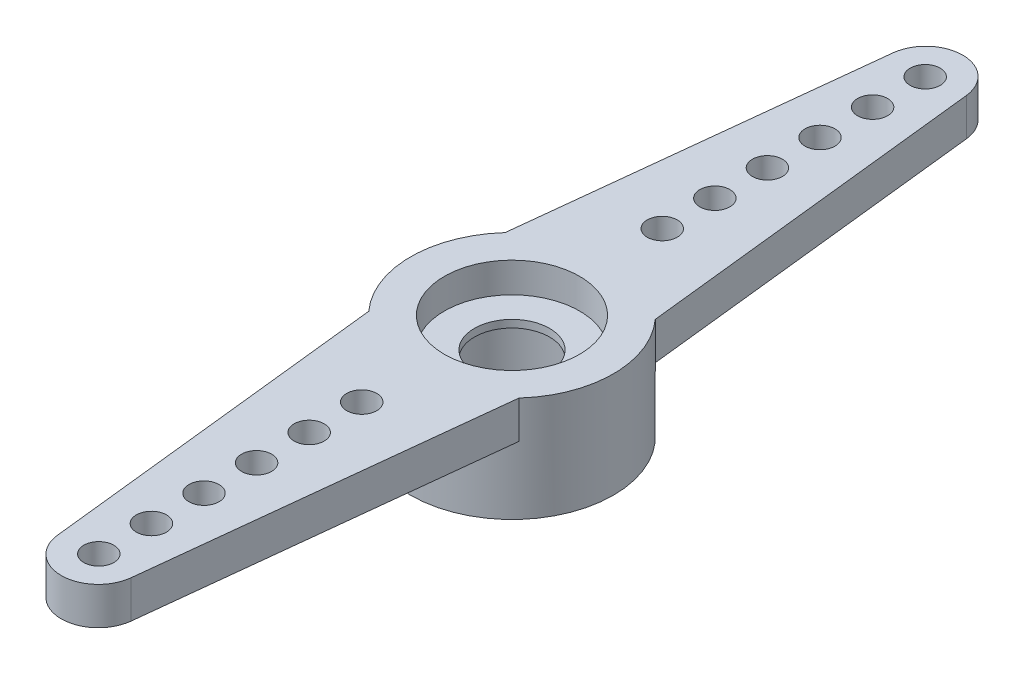
ISO-10303-21;
HEADER;
FILE_DESCRIPTION(('STEP AP214'),'2;1');
FILE_NAME('part.step','',(''),(''),'','','');
FILE_SCHEMA(('AUTOMOTIVE_DESIGN { 1 0 10303 214 1 1 1 1 }'));
ENDSEC;
DATA;
#1=APPLICATION_CONTEXT('core data for automotive mechanical design processes');
#2=APPLICATION_PROTOCOL_DEFINITION('international standard','automotive_design',2000,#1);
#3=PRODUCT_CONTEXT('',#1,'mechanical');
#4=PRODUCT('Part','Part','',(#3));
#5=PRODUCT_RELATED_PRODUCT_CATEGORY('part','',(#4));
#6=PRODUCT_DEFINITION_FORMATION('','',#4);
#7=PRODUCT_DEFINITION_CONTEXT('part definition',#1,'design');
#8=PRODUCT_DEFINITION('design','',#6,#7);
#9=PRODUCT_DEFINITION_SHAPE('','',#8);
#10=(LENGTH_UNIT() NAMED_UNIT(*) SI_UNIT(.MILLI.,.METRE.));
#11=(NAMED_UNIT(*) PLANE_ANGLE_UNIT() SI_UNIT($,.RADIAN.));
#12=(NAMED_UNIT(*) SI_UNIT($,.STERADIAN.) SOLID_ANGLE_UNIT());
#13=UNCERTAINTY_MEASURE_WITH_UNIT(LENGTH_MEASURE(1.E-05),#10,'distance_accuracy_value','');
#14=(GEOMETRIC_REPRESENTATION_CONTEXT(3) GLOBAL_UNCERTAINTY_ASSIGNED_CONTEXT((#13)) GLOBAL_UNIT_ASSIGNED_CONTEXT((#10,
#11,#12)) REPRESENTATION_CONTEXT('',''));
#15=CARTESIAN_POINT('',(0.,0.,0.));
#16=DIRECTION('',(0.,0.,1.));
#17=DIRECTION('',(1.,0.,0.));
#18=AXIS2_PLACEMENT_3D('',#15,#16,#17);
#19=CARTESIAN_POINT('',(0.,3.556,0.));
#20=DIRECTION('',(0.,-1.,0.));
#21=DIRECTION('',(0.,0.,-1.));
#22=AXIS2_PLACEMENT_3D('',#19,#20,#21);
#23=CYLINDRICAL_SURFACE('',#22,3.429);
#24=DIRECTION('',(0.,1.,0.));
#25=VECTOR('',#24,1.);
#26=CARTESIAN_POINT('',(-2.54,2.286,2.30357135769657));
#27=LINE('',#26,#25);
#28=CARTESIAN_POINT('',(-2.54,2.286,2.30357135769657));
#29=VERTEX_POINT('',#28);
#30=CARTESIAN_POINT('',(-2.54,3.556,2.30357135769657));
#31=VERTEX_POINT('',#30);
#32=EDGE_CURVE('E159',#29,#31,#27,.T.);
#33=ORIENTED_EDGE('',*,*,#32,.T.);
#34=CARTESIAN_POINT('',(0.,3.556,0.));
#35=DIRECTION('',(0.,1.,0.));
#36=DIRECTION('',(0.,0.,1.));
#37=AXIS2_PLACEMENT_3D('',#34,#35,#36);
#38=CIRCLE('',#37,3.429);
#39=CARTESIAN_POINT('',(-2.54,3.556,-2.30357135769657));
#40=VERTEX_POINT('',#39);
#41=EDGE_CURVE('E254',#40,#31,#38,.T.);
#42=ORIENTED_EDGE('',*,*,#41,.F.);
#43=DIRECTION('',(0.,1.,0.));
#44=VECTOR('',#43,1.);
#45=CARTESIAN_POINT('',(-2.54,2.286,-2.30357135769657));
#46=LINE('',#45,#44);
#47=CARTESIAN_POINT('',(-2.54,2.286,-2.30357135769657));
#48=VERTEX_POINT('',#47);
#49=EDGE_CURVE('E55',#48,#40,#46,.T.);
#50=ORIENTED_EDGE('',*,*,#49,.F.);
#51=CARTESIAN_POINT('',(0.,2.286,0.));
#52=DIRECTION('',(0.,1.,0.));
#53=DIRECTION('',(0.,0.,1.));
#54=AXIS2_PLACEMENT_3D('',#51,#52,#53);
#55=CIRCLE('',#54,3.429);
#56=CARTESIAN_POINT('',(2.54,2.286,-2.30357135769657));
#57=VERTEX_POINT('',#56);
#58=EDGE_CURVE('E215',#57,#48,#55,.T.);
#59=ORIENTED_EDGE('',*,*,#58,.F.);
#60=DIRECTION('',(0.,1.,0.));
#61=VECTOR('',#60,1.);
#62=CARTESIAN_POINT('',(2.54,2.286,-2.30357135769657));
#63=LINE('',#62,#61);
#64=CARTESIAN_POINT('',(2.54,3.556,-2.30357135769657));
#65=VERTEX_POINT('',#64);
#66=EDGE_CURVE('E83',#57,#65,#63,.T.);
#67=ORIENTED_EDGE('',*,*,#66,.T.);
#68=CARTESIAN_POINT('',(2.54,3.556,2.30357135769657));
#69=VERTEX_POINT('',#68);
#70=EDGE_CURVE('E137',#69,#65,#38,.T.);
#71=ORIENTED_EDGE('',*,*,#70,.F.);
#72=DIRECTION('',(0.,1.,0.));
#73=VECTOR('',#72,1.);
#74=CARTESIAN_POINT('',(2.54,2.286,2.30357135769657));
#75=LINE('',#74,#73);
#76=CARTESIAN_POINT('',(2.54,2.286,2.30357135769657));
#77=VERTEX_POINT('',#76);
#78=EDGE_CURVE('E117',#77,#69,#75,.T.);
#79=ORIENTED_EDGE('',*,*,#78,.F.);
#80=CARTESIAN_POINT('',(0.,2.286,0.));
#81=DIRECTION('',(0.,-1.,0.));
#82=DIRECTION('',(0.,0.,-1.));
#83=AXIS2_PLACEMENT_3D('',#80,#81,#82);
#84=CIRCLE('',#83,3.429);
#85=EDGE_CURVE('E123',#77,#29,#84,.T.);
#86=ORIENTED_EDGE('',*,*,#85,.T.);
#87=EDGE_LOOP('',(#33,#42,#50,#59,#67,#71,#79,#86));
#88=FACE_BOUND('',#87,.T.);
#89=CARTESIAN_POINT('',(0.,0.,0.));
#90=DIRECTION('',(0.,1.,0.));
#91=DIRECTION('',(0.,0.,1.));
#92=AXIS2_PLACEMENT_3D('',#89,#90,#91);
#93=CIRCLE('',#92,3.429);
#94=CARTESIAN_POINT('',(0.,0.,3.429));
#95=VERTEX_POINT('',#94);
#96=EDGE_CURVE('E250',#95,#95,#93,.T.);
#97=ORIENTED_EDGE('',*,*,#96,.T.);
#98=EDGE_LOOP('',(#97));
#99=FACE_BOUND('',#98,.T.);
#100=ADVANCED_FACE('F38',(#88,#99),#23,.T.);
#101=CARTESIAN_POINT('',(0.,0.,-12.192));
#102=DIRECTION('',(0.,1.,0.));
#103=DIRECTION('',(0.,0.,1.));
#104=AXIS2_PLACEMENT_3D('',#101,#102,#103);
#105=CYLINDRICAL_SURFACE('',#104,0.508);
#106=CARTESIAN_POINT('',(0.,3.556,-12.192));
#107=DIRECTION('',(0.,1.,0.));
#108=DIRECTION('',(0.,0.,1.));
#109=AXIS2_PLACEMENT_3D('',#106,#107,#108);
#110=CIRCLE('',#109,0.508);
#111=CARTESIAN_POINT('',(0.,3.556,-11.684));
#112=VERTEX_POINT('',#111);
#113=EDGE_CURVE('E48',#112,#112,#110,.T.);
#114=ORIENTED_EDGE('',*,*,#113,.T.);
#115=EDGE_LOOP('',(#114));
#116=FACE_BOUND('',#115,.T.);
#117=CARTESIAN_POINT('',(0.,2.286,-12.192));
#118=DIRECTION('',(0.,1.,0.));
#119=DIRECTION('',(0.,0.,1.));
#120=AXIS2_PLACEMENT_3D('',#117,#118,#119);
#121=CIRCLE('',#120,0.508);
#122=CARTESIAN_POINT('',(0.,2.286,-11.684));
#123=VERTEX_POINT('',#122);
#124=EDGE_CURVE('E11',#123,#123,#121,.T.);
#125=ORIENTED_EDGE('',*,*,#124,.F.);
#126=EDGE_LOOP('',(#125));
#127=FACE_BOUND('',#126,.T.);
#128=ADVANCED_FACE('F40',(#116,#127),#105,.F.);
#129=CARTESIAN_POINT('',(0.,0.,-10.414));
#130=DIRECTION('',(0.,1.,0.));
#131=DIRECTION('',(0.,0.,1.));
#132=AXIS2_PLACEMENT_3D('',#129,#130,#131);
#133=CYLINDRICAL_SURFACE('',#132,0.508);
#134=CARTESIAN_POINT('',(0.,3.556,-10.414));
#135=DIRECTION('',(0.,1.,0.));
#136=DIRECTION('',(0.,0.,1.));
#137=AXIS2_PLACEMENT_3D('',#134,#135,#136);
#138=CIRCLE('',#137,0.508);
#139=CARTESIAN_POINT('',(0.,3.556,-9.906));
#140=VERTEX_POINT('',#139);
#141=EDGE_CURVE('E275',#140,#140,#138,.T.);
#142=ORIENTED_EDGE('',*,*,#141,.T.);
#143=EDGE_LOOP('',(#142));
#144=FACE_BOUND('',#143,.T.);
#145=CARTESIAN_POINT('',(0.,2.286,-10.414));
#146=DIRECTION('',(0.,1.,0.));
#147=DIRECTION('',(0.,0.,1.));
#148=AXIS2_PLACEMENT_3D('',#145,#146,#147);
#149=CIRCLE('',#148,0.508);
#150=CARTESIAN_POINT('',(0.,2.286,-9.906));
#151=VERTEX_POINT('',#150);
#152=EDGE_CURVE('E279',#151,#151,#149,.T.);
#153=ORIENTED_EDGE('',*,*,#152,.F.);
#154=EDGE_LOOP('',(#153));
#155=FACE_BOUND('',#154,.T.);
#156=ADVANCED_FACE('F342',(#144,#155),#133,.F.);
#157=CARTESIAN_POINT('',(0.,0.,-8.636));
#158=DIRECTION('',(0.,1.,0.));
#159=DIRECTION('',(0.,0.,1.));
#160=AXIS2_PLACEMENT_3D('',#157,#158,#159);
#161=CYLINDRICAL_SURFACE('',#160,0.508);
#162=CARTESIAN_POINT('',(0.,3.556,-8.636));
#163=DIRECTION('',(0.,1.,0.));
#164=DIRECTION('',(0.,0.,1.));
#165=AXIS2_PLACEMENT_3D('',#162,#163,#164);
#166=CIRCLE('',#165,0.508);
#167=CARTESIAN_POINT('',(0.,3.556,-8.128));
#168=VERTEX_POINT('',#167);
#169=EDGE_CURVE('E264',#168,#168,#166,.T.);
#170=ORIENTED_EDGE('',*,*,#169,.T.);
#171=EDGE_LOOP('',(#170));
#172=FACE_BOUND('',#171,.T.);
#173=CARTESIAN_POINT('',(0.,2.286,-8.636));
#174=DIRECTION('',(0.,1.,0.));
#175=DIRECTION('',(0.,0.,1.));
#176=AXIS2_PLACEMENT_3D('',#173,#174,#175);
#177=CIRCLE('',#176,0.508);
#178=CARTESIAN_POINT('',(0.,2.286,-8.128));
#179=VERTEX_POINT('',#178);
#180=EDGE_CURVE('E271',#179,#179,#177,.T.);
#181=ORIENTED_EDGE('',*,*,#180,.F.);
#182=EDGE_LOOP('',(#181));
#183=FACE_BOUND('',#182,.T.);
#184=ADVANCED_FACE('F345',(#172,#183),#161,.F.);
#185=CARTESIAN_POINT('',(0.,3.556,0.));
#186=DIRECTION('',(0.,-1.,0.));
#187=DIRECTION('',(0.,0.,-1.));
#188=AXIS2_PLACEMENT_3D('',#185,#186,#187);
#189=CYLINDRICAL_SURFACE('',#188,2.286);
#190=CARTESIAN_POINT('',(0.,2.286,0.));
#191=DIRECTION('',(0.,1.,0.));
#192=DIRECTION('',(0.,0.,1.));
#193=AXIS2_PLACEMENT_3D('',#190,#191,#192);
#194=CIRCLE('',#193,2.286);
#195=CARTESIAN_POINT('',(0.,2.286,2.286));
#196=VERTEX_POINT('',#195);
#197=EDGE_CURVE('E202',#196,#196,#194,.F.);
#198=ORIENTED_EDGE('',*,*,#197,.F.);
#199=EDGE_LOOP('',(#198));
#200=FACE_BOUND('',#199,.T.);
#201=CARTESIAN_POINT('',(0.,0.,0.));
#202=DIRECTION('',(0.,1.,0.));
#203=DIRECTION('',(0.,0.,1.));
#204=AXIS2_PLACEMENT_3D('',#201,#202,#203);
#205=CIRCLE('',#204,2.286);
#206=CARTESIAN_POINT('',(0.,0.,2.286));
#207=VERTEX_POINT('',#206);
#208=EDGE_CURVE('E237',#207,#207,#205,.T.);
#209=ORIENTED_EDGE('',*,*,#208,.F.);
#210=EDGE_LOOP('',(#209));
#211=FACE_BOUND('',#210,.T.);
#212=ADVANCED_FACE('F293',(#200,#211),#189,.F.);
#213=CARTESIAN_POINT('',(0.,3.556,0.));
#214=DIRECTION('',(0.,1.,0.));
#215=DIRECTION('',(0.,0.,1.));
#216=AXIS2_PLACEMENT_3D('',#213,#214,#215);
#217=PLANE('',#216);
#218=ORIENTED_EDGE('',*,*,#41,.T.);
#219=DIRECTION('',(0.108941168435119,0.,0.994048198942079));
#220=VECTOR('',#219,1.);
#221=CARTESIAN_POINT('',(-2.75931495587774,3.556,0.302402836898391));
#222=LINE('',#221,#220);
#223=CARTESIAN_POINT('',(-1.24451166089778,3.556,14.1244272263572));
#224=VERTEX_POINT('',#223);
#225=EDGE_CURVE('E134',#31,#224,#222,.T.);
#226=ORIENTED_EDGE('',*,*,#225,.T.);
#227=CARTESIAN_POINT('',(0.,3.556,13.9880369038219));
#228=DIRECTION('',(0.,-1.,0.));
#229=DIRECTION('',(0.,0.,-1.));
#230=AXIS2_PLACEMENT_3D('',#227,#228,#229);
#231=CIRCLE('',#230,1.25196309617809);
#232=CARTESIAN_POINT('',(1.24451166089778,3.556,14.1244272263572));
#233=VERTEX_POINT('',#232);
#234=EDGE_CURVE('E447',#224,#233,#231,.F.);
#235=ORIENTED_EDGE('',*,*,#234,.T.);
#236=DIRECTION('',(-0.108941168435119,0.,0.994048198942079));
#237=VECTOR('',#236,1.);
#238=CARTESIAN_POINT('',(2.75931495587774,3.556,0.302402836898391));
#239=LINE('',#238,#237);
#240=EDGE_CURVE('E152',#69,#233,#239,.T.);
#241=ORIENTED_EDGE('',*,*,#240,.F.);
#242=ORIENTED_EDGE('',*,*,#70,.T.);
#243=DIRECTION('',(-0.108941168435119,0.,-0.994048198942079));
#244=VECTOR('',#243,1.);
#245=CARTESIAN_POINT('',(2.75931495587774,3.556,-0.302402836898391));
#246=LINE('',#245,#244);
#247=CARTESIAN_POINT('',(1.24451166089778,3.556,-14.1244272263572));
#248=VERTEX_POINT('',#247);
#249=EDGE_CURVE('E211',#65,#248,#246,.T.);
#250=ORIENTED_EDGE('',*,*,#249,.T.);
#251=CARTESIAN_POINT('',(0.,3.556,-13.9880369038219));
#252=DIRECTION('',(0.,1.,0.));
#253=DIRECTION('',(0.,0.,1.));
#254=AXIS2_PLACEMENT_3D('',#251,#252,#253);
#255=CIRCLE('',#254,1.25196309617809);
#256=CARTESIAN_POINT('',(-1.24451166089778,3.556,-14.1244272263572));
#257=VERTEX_POINT('',#256);
#258=EDGE_CURVE('E229',#257,#248,#255,.F.);
#259=ORIENTED_EDGE('',*,*,#258,.F.);
#260=DIRECTION('',(0.108941168435119,0.,-0.994048198942079));
#261=VECTOR('',#260,1.);
#262=CARTESIAN_POINT('',(-2.75931495587774,3.556,-0.302402836898391));
#263=LINE('',#262,#261);
#264=EDGE_CURVE('E75',#40,#257,#263,.T.);
#265=ORIENTED_EDGE('',*,*,#264,.F.);
#266=EDGE_LOOP('',(#218,#226,#235,#241,#242,#250,#259,#265));
#267=FACE_BOUND('',#266,.T.);
#268=CARTESIAN_POINT('',(0.,3.556,0.));
#269=DIRECTION('',(0.,1.,0.));
#270=DIRECTION('',(0.,0.,1.));
#271=AXIS2_PLACEMENT_3D('',#268,#269,#270);
#272=CIRCLE('',#271,2.286);
#273=CARTESIAN_POINT('',(0.,3.556,2.286));
#274=VERTEX_POINT('',#273);
#275=EDGE_CURVE('E246',#274,#274,#272,.T.);
#276=ORIENTED_EDGE('',*,*,#275,.F.);
#277=EDGE_LOOP('',(#276));
#278=FACE_BOUND('',#277,.T.);
#279=CARTESIAN_POINT('',(0.,3.556,-13.97));
#280=DIRECTION('',(0.,1.,0.));
#281=DIRECTION('',(0.,0.,1.));
#282=AXIS2_PLACEMENT_3D('',#279,#280,#281);
#283=CIRCLE('',#282,0.508);
#284=CARTESIAN_POINT('',(0.,3.556,-13.462));
#285=VERTEX_POINT('',#284);
#286=EDGE_CURVE('E179',#285,#285,#283,.T.);
#287=ORIENTED_EDGE('',*,*,#286,.F.);
#288=EDGE_LOOP('',(#287));
#289=FACE_BOUND('',#288,.T.);
#290=CARTESIAN_POINT('',(0.,3.556,-6.858));
#291=DIRECTION('',(0.,1.,0.));
#292=DIRECTION('',(0.,0.,1.));
#293=AXIS2_PLACEMENT_3D('',#290,#291,#292);
#294=CIRCLE('',#293,0.508);
#295=CARTESIAN_POINT('',(0.,3.556,-6.35));
#296=VERTEX_POINT('',#295);
#297=EDGE_CURVE('E189',#296,#296,#294,.T.);
#298=ORIENTED_EDGE('',*,*,#297,.F.);
#299=EDGE_LOOP('',(#298));
#300=FACE_BOUND('',#299,.T.);
#301=CARTESIAN_POINT('',(0.,3.556,-5.08));
#302=DIRECTION('',(0.,1.,0.));
#303=DIRECTION('',(0.,0.,1.));
#304=AXIS2_PLACEMENT_3D('',#301,#302,#303);
#305=CIRCLE('',#304,0.508);
#306=CARTESIAN_POINT('',(0.,3.556,-4.572));
#307=VERTEX_POINT('',#306);
#308=EDGE_CURVE('E197',#307,#307,#305,.T.);
#309=ORIENTED_EDGE('',*,*,#308,.F.);
#310=EDGE_LOOP('',(#309));
#311=FACE_BOUND('',#310,.T.);
#312=ORIENTED_EDGE('',*,*,#169,.F.);
#313=EDGE_LOOP('',(#312));
#314=FACE_BOUND('',#313,.T.);
#315=ORIENTED_EDGE('',*,*,#141,.F.);
#316=EDGE_LOOP('',(#315));
#317=FACE_BOUND('',#316,.T.);
#318=ORIENTED_EDGE('',*,*,#113,.F.);
#319=EDGE_LOOP('',(#318));
#320=FACE_BOUND('',#319,.T.);
#321=CARTESIAN_POINT('',(0.,3.556,13.97));
#322=DIRECTION('',(0.,-1.,0.));
#323=DIRECTION('',(0.,0.,-1.));
#324=AXIS2_PLACEMENT_3D('',#321,#322,#323);
#325=CIRCLE('',#324,0.508);
#326=CARTESIAN_POINT('',(0.,3.556,13.462));
#327=VERTEX_POINT('',#326);
#328=EDGE_CURVE('E185',#327,#327,#325,.T.);
#329=ORIENTED_EDGE('',*,*,#328,.T.);
#330=EDGE_LOOP('',(#329));
#331=FACE_BOUND('',#330,.T.);
#332=CARTESIAN_POINT('',(0.,3.556,6.858));
#333=DIRECTION('',(0.,-1.,0.));
#334=DIRECTION('',(0.,0.,-1.));
#335=AXIS2_PLACEMENT_3D('',#332,#333,#334);
#336=CIRCLE('',#335,0.508);
#337=CARTESIAN_POINT('',(0.,3.556,6.35));
#338=VERTEX_POINT('',#337);
#339=EDGE_CURVE('E184',#338,#338,#336,.T.);
#340=ORIENTED_EDGE('',*,*,#339,.T.);
#341=EDGE_LOOP('',(#340));
#342=FACE_BOUND('',#341,.T.);
#343=CARTESIAN_POINT('',(0.,3.556,5.08));
#344=DIRECTION('',(0.,-1.,0.));
#345=DIRECTION('',(0.,0.,-1.));
#346=AXIS2_PLACEMENT_3D('',#343,#344,#345);
#347=CIRCLE('',#346,0.508);
#348=CARTESIAN_POINT('',(0.,3.556,4.572));
#349=VERTEX_POINT('',#348);
#350=EDGE_CURVE('E153',#349,#349,#347,.T.);
#351=ORIENTED_EDGE('',*,*,#350,.T.);
#352=EDGE_LOOP('',(#351));
#353=FACE_BOUND('',#352,.T.);
#354=CARTESIAN_POINT('',(0.,3.556,8.636));
#355=DIRECTION('',(0.,-1.,0.));
#356=DIRECTION('',(0.,0.,-1.));
#357=AXIS2_PLACEMENT_3D('',#354,#355,#356);
#358=CIRCLE('',#357,0.508);
#359=CARTESIAN_POINT('',(0.,3.556,8.128));
#360=VERTEX_POINT('',#359);
#361=EDGE_CURVE('E154',#360,#360,#358,.T.);
#362=ORIENTED_EDGE('',*,*,#361,.T.);
#363=EDGE_LOOP('',(#362));
#364=FACE_BOUND('',#363,.T.);
#365=CARTESIAN_POINT('',(0.,3.556,10.414));
#366=DIRECTION('',(0.,-1.,0.));
#367=DIRECTION('',(0.,0.,-1.));
#368=AXIS2_PLACEMENT_3D('',#365,#366,#367);
#369=CIRCLE('',#368,0.508);
#370=CARTESIAN_POINT('',(0.,3.556,9.906));
#371=VERTEX_POINT('',#370);
#372=EDGE_CURVE('E163',#371,#371,#369,.T.);
#373=ORIENTED_EDGE('',*,*,#372,.T.);
#374=EDGE_LOOP('',(#373));
#375=FACE_BOUND('',#374,.T.);
#376=CARTESIAN_POINT('',(0.,3.556,12.192));
#377=DIRECTION('',(0.,-1.,0.));
#378=DIRECTION('',(0.,0.,-1.));
#379=AXIS2_PLACEMENT_3D('',#376,#377,#378);
#380=CIRCLE('',#379,0.508);
#381=CARTESIAN_POINT('',(0.,3.556,11.684));
#382=VERTEX_POINT('',#381);
#383=EDGE_CURVE('E171',#382,#382,#380,.T.);
#384=ORIENTED_EDGE('',*,*,#383,.T.);
#385=EDGE_LOOP('',(#384));
#386=FACE_BOUND('',#385,.T.);
#387=ADVANCED_FACE('F289',(#267,#278,#289,#300,#311,#314,#317,#320,#331,#342,#353,#364,#375,
#386),#217,.T.);
#388=CARTESIAN_POINT('',(0.,0.,0.));
#389=DIRECTION('',(0.,1.,0.));
#390=DIRECTION('',(0.,0.,1.));
#391=AXIS2_PLACEMENT_3D('',#388,#389,#390);
#392=PLANE('',#391);
#393=ORIENTED_EDGE('',*,*,#208,.T.);
#394=EDGE_LOOP('',(#393));
#395=FACE_BOUND('',#394,.T.);
#396=ORIENTED_EDGE('',*,*,#96,.F.);
#397=EDGE_LOOP('',(#396));
#398=FACE_BOUND('',#397,.T.);
#399=ADVANCED_FACE('F292',(#395,#398),#392,.F.);
#400=ORIENTED_EDGE('',*,*,#275,.T.);
#401=EDGE_LOOP('',(#400));
#402=FACE_BOUND('',#401,.T.);
#403=CARTESIAN_POINT('',(0.,2.54,0.));
#404=DIRECTION('',(0.,1.,0.));
#405=DIRECTION('',(0.,0.,1.));
#406=AXIS2_PLACEMENT_3D('',#403,#404,#405);
#407=CIRCLE('',#406,2.286);
#408=CARTESIAN_POINT('',(0.,2.54,2.286));
#409=VERTEX_POINT('',#408);
#410=EDGE_CURVE('E257',#409,#409,#407,.T.);
#411=ORIENTED_EDGE('',*,*,#410,.F.);
#412=EDGE_LOOP('',(#411));
#413=FACE_BOUND('',#412,.T.);
#414=ADVANCED_FACE('F383',(#402,#413),#189,.F.);
#415=CARTESIAN_POINT('',(-2.75931495587774,2.286,-0.302402836898391));
#416=DIRECTION('',(0.994048198942079,0.,0.108941168435119));
#417=DIRECTION('',(0.108941168435119,0.,-0.994048198942079));
#418=AXIS2_PLACEMENT_3D('',#415,#416,#417);
#419=PLANE('',#418);
#420=ORIENTED_EDGE('',*,*,#264,.T.);
#421=DIRECTION('',(0.,1.,0.));
#422=VECTOR('',#421,1.);
#423=CARTESIAN_POINT('',(-1.24451166089778,2.286,-14.1244272263572));
#424=LINE('',#423,#422);
#425=CARTESIAN_POINT('',(-1.24451166089778,2.286,-14.1244272263572));
#426=VERTEX_POINT('',#425);
#427=EDGE_CURVE('E238',#426,#257,#424,.T.);
#428=ORIENTED_EDGE('',*,*,#427,.F.);
#429=DIRECTION('',(0.108941168435119,0.,-0.994048198942079));
#430=VECTOR('',#429,1.);
#431=CARTESIAN_POINT('',(-2.75931495587774,2.286,-0.302402836898391));
#432=LINE('',#431,#430);
#433=EDGE_CURVE('E61',#48,#426,#432,.T.);
#434=ORIENTED_EDGE('',*,*,#433,.F.);
#435=ORIENTED_EDGE('',*,*,#49,.T.);
#436=EDGE_LOOP('',(#420,#428,#434,#435));
#437=FACE_BOUND('',#436,.T.);
#438=ADVANCED_FACE('F380',(#437),#419,.F.);
#439=CARTESIAN_POINT('',(0.,2.286,-13.9880369038219));
#440=DIRECTION('',(0.,1.,0.));
#441=DIRECTION('',(0.,0.,1.));
#442=AXIS2_PLACEMENT_3D('',#439,#440,#441);
#443=CYLINDRICAL_SURFACE('',#442,1.25196309617809);
#444=ORIENTED_EDGE('',*,*,#258,.T.);
#445=DIRECTION('',(0.,1.,0.));
#446=VECTOR('',#445,1.);
#447=CARTESIAN_POINT('',(1.24451166089778,2.286,-14.1244272263572));
#448=LINE('',#447,#446);
#449=CARTESIAN_POINT('',(1.24451166089778,2.286,-14.1244272263572));
#450=VERTEX_POINT('',#449);
#451=EDGE_CURVE('E241',#450,#248,#448,.T.);
#452=ORIENTED_EDGE('',*,*,#451,.F.);
#453=CARTESIAN_POINT('',(0.,2.286,-13.9880369038219));
#454=DIRECTION('',(0.,1.,0.));
#455=DIRECTION('',(0.,0.,1.));
#456=AXIS2_PLACEMENT_3D('',#453,#454,#455);
#457=CIRCLE('',#456,1.25196309617809);
#458=EDGE_CURVE('E221',#426,#450,#457,.F.);
#459=ORIENTED_EDGE('',*,*,#458,.F.);
#460=ORIENTED_EDGE('',*,*,#427,.T.);
#461=EDGE_LOOP('',(#444,#452,#459,#460));
#462=FACE_BOUND('',#461,.T.);
#463=ADVANCED_FACE('F374',(#462),#443,.T.);
#464=CARTESIAN_POINT('',(2.75931495587774,2.286,-0.302402836898391));
#465=DIRECTION('',(0.994048198942079,0.,-0.108941168435119));
#466=DIRECTION('',(-0.108941168435119,0.,-0.994048198942079));
#467=AXIS2_PLACEMENT_3D('',#464,#465,#466);
#468=PLANE('',#467);
#469=ORIENTED_EDGE('',*,*,#249,.F.);
#470=ORIENTED_EDGE('',*,*,#66,.F.);
#471=DIRECTION('',(-0.108941168435119,0.,-0.994048198942079));
#472=VECTOR('',#471,1.);
#473=CARTESIAN_POINT('',(2.75931495587774,2.286,-0.302402836898391));
#474=LINE('',#473,#472);
#475=EDGE_CURVE('E218',#57,#450,#474,.T.);
#476=ORIENTED_EDGE('',*,*,#475,.T.);
#477=ORIENTED_EDGE('',*,*,#451,.T.);
#478=EDGE_LOOP('',(#469,#470,#476,#477));
#479=FACE_BOUND('',#478,.T.);
#480=ADVANCED_FACE('F362',(#479),#468,.T.);
#481=CARTESIAN_POINT('',(0.,2.286,0.));
#482=DIRECTION('',(0.,1.,0.));
#483=DIRECTION('',(0.,0.,1.));
#484=AXIS2_PLACEMENT_3D('',#481,#482,#483);
#485=PLANE('',#484);
#486=CARTESIAN_POINT('',(0.,2.286,-13.97));
#487=DIRECTION('',(0.,1.,0.));
#488=DIRECTION('',(0.,0.,1.));
#489=AXIS2_PLACEMENT_3D('',#486,#487,#488);
#490=CIRCLE('',#489,0.508);
#491=CARTESIAN_POINT('',(0.,2.286,-13.462));
#492=VERTEX_POINT('',#491);
#493=EDGE_CURVE('E42',#492,#492,#490,.T.);
#494=ORIENTED_EDGE('',*,*,#493,.T.);
#495=EDGE_LOOP('',(#494));
#496=FACE_BOUND('',#495,.T.);
#497=CARTESIAN_POINT('',(0.,2.286,-6.858));
#498=DIRECTION('',(0.,1.,0.));
#499=DIRECTION('',(0.,0.,1.));
#500=AXIS2_PLACEMENT_3D('',#497,#498,#499);
#501=CIRCLE('',#500,0.508);
#502=CARTESIAN_POINT('',(0.,2.286,-6.35));
#503=VERTEX_POINT('',#502);
#504=EDGE_CURVE('E193',#503,#503,#501,.T.);
#505=ORIENTED_EDGE('',*,*,#504,.T.);
#506=EDGE_LOOP('',(#505));
#507=FACE_BOUND('',#506,.T.);
#508=CARTESIAN_POINT('',(0.,2.286,-5.08));
#509=DIRECTION('',(0.,1.,0.));
#510=DIRECTION('',(0.,0.,1.));
#511=AXIS2_PLACEMENT_3D('',#508,#509,#510);
#512=CIRCLE('',#511,0.508);
#513=CARTESIAN_POINT('',(0.,2.286,-4.572));
#514=VERTEX_POINT('',#513);
#515=EDGE_CURVE('E201',#514,#514,#512,.T.);
#516=ORIENTED_EDGE('',*,*,#515,.T.);
#517=EDGE_LOOP('',(#516));
#518=FACE_BOUND('',#517,.T.);
#519=ORIENTED_EDGE('',*,*,#58,.T.);
#520=ORIENTED_EDGE('',*,*,#433,.T.);
#521=ORIENTED_EDGE('',*,*,#458,.T.);
#522=ORIENTED_EDGE('',*,*,#475,.F.);
#523=EDGE_LOOP('',(#519,#520,#521,#522));
#524=FACE_BOUND('',#523,.T.);
#525=ORIENTED_EDGE('',*,*,#180,.T.);
#526=EDGE_LOOP('',(#525));
#527=FACE_BOUND('',#526,.T.);
#528=ORIENTED_EDGE('',*,*,#152,.T.);
#529=EDGE_LOOP('',(#528));
#530=FACE_BOUND('',#529,.T.);
#531=ORIENTED_EDGE('',*,*,#124,.T.);
#532=EDGE_LOOP('',(#531));
#533=FACE_BOUND('',#532,.T.);
#534=ADVANCED_FACE('F358',(#496,#507,#518,#524,#527,#530,#533),#485,.F.);
#535=CARTESIAN_POINT('',(0.,2.286,0.));
#536=DIRECTION('',(0.,1.,0.));
#537=DIRECTION('',(0.,0.,1.));
#538=AXIS2_PLACEMENT_3D('',#535,#536,#537);
#539=CYLINDRICAL_SURFACE('',#538,1.27);
#540=CARTESIAN_POINT('',(0.,2.286,0.));
#541=DIRECTION('',(0.,1.,0.));
#542=DIRECTION('',(0.,0.,1.));
#543=AXIS2_PLACEMENT_3D('',#540,#541,#542);
#544=CIRCLE('',#543,1.27);
#545=CARTESIAN_POINT('',(0.,2.286,1.27));
#546=VERTEX_POINT('',#545);
#547=EDGE_CURVE('E206',#546,#546,#544,.T.);
#548=ORIENTED_EDGE('',*,*,#547,.F.);
#549=EDGE_LOOP('',(#548));
#550=FACE_BOUND('',#549,.T.);
#551=CARTESIAN_POINT('',(0.,2.54,0.));
#552=DIRECTION('',(0.,1.,0.));
#553=DIRECTION('',(0.,0.,1.));
#554=AXIS2_PLACEMENT_3D('',#551,#552,#553);
#555=CIRCLE('',#554,1.27);
#556=CARTESIAN_POINT('',(0.,2.54,1.27));
#557=VERTEX_POINT('',#556);
#558=EDGE_CURVE('E207',#557,#557,#555,.T.);
#559=ORIENTED_EDGE('',*,*,#558,.T.);
#560=EDGE_LOOP('',(#559));
#561=FACE_BOUND('',#560,.T.);
#562=ADVANCED_FACE('F361',(#550,#561),#539,.F.);
#563=CARTESIAN_POINT('',(0.,2.286,0.));
#564=DIRECTION('',(0.,1.,0.));
#565=DIRECTION('',(0.,0.,1.));
#566=AXIS2_PLACEMENT_3D('',#563,#564,#565);
#567=PLANE('',#566);
#568=ORIENTED_EDGE('',*,*,#197,.T.);
#569=EDGE_LOOP('',(#568));
#570=FACE_BOUND('',#569,.T.);
#571=ORIENTED_EDGE('',*,*,#547,.T.);
#572=EDGE_LOOP('',(#571));
#573=FACE_BOUND('',#572,.T.);
#574=ADVANCED_FACE('F370',(#570,#573),#567,.F.);
#575=CARTESIAN_POINT('',(0.,2.54,0.));
#576=DIRECTION('',(0.,1.,0.));
#577=DIRECTION('',(0.,0.,1.));
#578=AXIS2_PLACEMENT_3D('',#575,#576,#577);
#579=PLANE('',#578);
#580=ORIENTED_EDGE('',*,*,#410,.T.);
#581=EDGE_LOOP('',(#580));
#582=FACE_BOUND('',#581,.T.);
#583=ORIENTED_EDGE('',*,*,#558,.F.);
#584=EDGE_LOOP('',(#583));
#585=FACE_BOUND('',#584,.T.);
#586=ADVANCED_FACE('F405',(#582,#585),#579,.T.);
#587=CARTESIAN_POINT('',(0.,0.,-5.08));
#588=DIRECTION('',(0.,1.,0.));
#589=DIRECTION('',(0.,0.,1.));
#590=AXIS2_PLACEMENT_3D('',#587,#588,#589);
#591=CYLINDRICAL_SURFACE('',#590,0.508);
#592=ORIENTED_EDGE('',*,*,#308,.T.);
#593=EDGE_LOOP('',(#592));
#594=FACE_BOUND('',#593,.T.);
#595=ORIENTED_EDGE('',*,*,#515,.F.);
#596=EDGE_LOOP('',(#595));
#597=FACE_BOUND('',#596,.T.);
#598=ADVANCED_FACE('F412',(#594,#597),#591,.F.);
#599=CARTESIAN_POINT('',(0.,0.,-6.858));
#600=DIRECTION('',(0.,1.,0.));
#601=DIRECTION('',(0.,0.,1.));
#602=AXIS2_PLACEMENT_3D('',#599,#600,#601);
#603=CYLINDRICAL_SURFACE('',#602,0.508);
#604=ORIENTED_EDGE('',*,*,#297,.T.);
#605=EDGE_LOOP('',(#604));
#606=FACE_BOUND('',#605,.T.);
#607=ORIENTED_EDGE('',*,*,#504,.F.);
#608=EDGE_LOOP('',(#607));
#609=FACE_BOUND('',#608,.T.);
#610=ADVANCED_FACE('F417',(#606,#609),#603,.F.);
#611=CARTESIAN_POINT('',(0.,0.,-13.97));
#612=DIRECTION('',(0.,1.,0.));
#613=DIRECTION('',(0.,0.,1.));
#614=AXIS2_PLACEMENT_3D('',#611,#612,#613);
#615=CYLINDRICAL_SURFACE('',#614,0.508);
#616=ORIENTED_EDGE('',*,*,#286,.T.);
#617=EDGE_LOOP('',(#616));
#618=FACE_BOUND('',#617,.T.);
#619=ORIENTED_EDGE('',*,*,#493,.F.);
#620=EDGE_LOOP('',(#619));
#621=FACE_BOUND('',#620,.T.);
#622=ADVANCED_FACE('F315',(#618,#621),#615,.F.);
#623=CARTESIAN_POINT('',(0.,0.,12.192));
#624=DIRECTION('',(0.,1.,0.));
#625=DIRECTION('',(0.,0.,-1.));
#626=AXIS2_PLACEMENT_3D('',#623,#624,#625);
#627=CYLINDRICAL_SURFACE('',#626,0.508);
#628=ORIENTED_EDGE('',*,*,#383,.F.);
#629=EDGE_LOOP('',(#628));
#630=FACE_BOUND('',#629,.T.);
#631=CARTESIAN_POINT('',(0.,2.286,12.192));
#632=DIRECTION('',(0.,-1.,0.));
#633=DIRECTION('',(0.,0.,-1.));
#634=AXIS2_PLACEMENT_3D('',#631,#632,#633);
#635=CIRCLE('',#634,0.508);
#636=CARTESIAN_POINT('',(0.,2.286,11.684));
#637=VERTEX_POINT('',#636);
#638=EDGE_CURVE('E175',#637,#637,#635,.T.);
#639=ORIENTED_EDGE('',*,*,#638,.T.);
#640=EDGE_LOOP('',(#639));
#641=FACE_BOUND('',#640,.T.);
#642=ADVANCED_FACE('F311',(#630,#641),#627,.F.);
#643=CARTESIAN_POINT('',(0.,0.,10.414));
#644=DIRECTION('',(0.,1.,0.));
#645=DIRECTION('',(0.,0.,-1.));
#646=AXIS2_PLACEMENT_3D('',#643,#644,#645);
#647=CYLINDRICAL_SURFACE('',#646,0.508);
#648=ORIENTED_EDGE('',*,*,#372,.F.);
#649=EDGE_LOOP('',(#648));
#650=FACE_BOUND('',#649,.T.);
#651=CARTESIAN_POINT('',(0.,2.286,10.414));
#652=DIRECTION('',(0.,-1.,0.));
#653=DIRECTION('',(0.,0.,-1.));
#654=AXIS2_PLACEMENT_3D('',#651,#652,#653);
#655=CIRCLE('',#654,0.508);
#656=CARTESIAN_POINT('',(0.,2.286,9.906));
#657=VERTEX_POINT('',#656);
#658=EDGE_CURVE('E167',#657,#657,#655,.T.);
#659=ORIENTED_EDGE('',*,*,#658,.T.);
#660=EDGE_LOOP('',(#659));
#661=FACE_BOUND('',#660,.T.);
#662=ADVANCED_FACE('F314',(#650,#661),#647,.F.);
#663=CARTESIAN_POINT('',(0.,0.,8.636));
#664=DIRECTION('',(0.,1.,0.));
#665=DIRECTION('',(0.,0.,-1.));
#666=AXIS2_PLACEMENT_3D('',#663,#664,#665);
#667=CYLINDRICAL_SURFACE('',#666,0.508);
#668=ORIENTED_EDGE('',*,*,#361,.F.);
#669=EDGE_LOOP('',(#668));
#670=FACE_BOUND('',#669,.T.);
#671=CARTESIAN_POINT('',(0.,2.286,8.636));
#672=DIRECTION('',(0.,-1.,0.));
#673=DIRECTION('',(0.,0.,-1.));
#674=AXIS2_PLACEMENT_3D('',#671,#672,#673);
#675=CIRCLE('',#674,0.508);
#676=CARTESIAN_POINT('',(0.,2.286,8.128));
#677=VERTEX_POINT('',#676);
#678=EDGE_CURVE('E158',#677,#677,#675,.T.);
#679=ORIENTED_EDGE('',*,*,#678,.T.);
#680=EDGE_LOOP('',(#679));
#681=FACE_BOUND('',#680,.T.);
#682=ADVANCED_FACE('F429',(#670,#681),#667,.F.);
#683=CARTESIAN_POINT('',(-2.75931495587774,2.286,0.302402836898391));
#684=DIRECTION('',(0.994048198942079,0.,-0.108941168435119));
#685=DIRECTION('',(0.108941168435119,0.,0.994048198942079));
#686=AXIS2_PLACEMENT_3D('',#683,#684,#685);
#687=PLANE('',#686);
#688=ORIENTED_EDGE('',*,*,#225,.F.);
#689=ORIENTED_EDGE('',*,*,#32,.F.);
#690=DIRECTION('',(0.108941168435119,0.,0.994048198942079));
#691=VECTOR('',#690,1.);
#692=CARTESIAN_POINT('',(-2.75931495587774,2.286,0.302402836898391));
#693=LINE('',#692,#691);
#694=CARTESIAN_POINT('',(-1.24451166089778,2.286,14.1244272263572));
#695=VERTEX_POINT('',#694);
#696=EDGE_CURVE('E129',#29,#695,#693,.T.);
#697=ORIENTED_EDGE('',*,*,#696,.T.);
#698=DIRECTION('',(0.,1.,0.));
#699=VECTOR('',#698,1.);
#700=CARTESIAN_POINT('',(-1.24451166089778,2.286,14.1244272263572));
#701=LINE('',#700,#699);
#702=EDGE_CURVE('E143',#695,#224,#701,.T.);
#703=ORIENTED_EDGE('',*,*,#702,.T.);
#704=EDGE_LOOP('',(#688,#689,#697,#703));
#705=FACE_BOUND('',#704,.T.);
#706=ADVANCED_FACE('F432',(#705),#687,.F.);
#707=CARTESIAN_POINT('',(0.,2.286,13.9880369038219));
#708=DIRECTION('',(0.,1.,0.));
#709=DIRECTION('',(0.,0.,-1.));
#710=AXIS2_PLACEMENT_3D('',#707,#708,#709);
#711=CYLINDRICAL_SURFACE('',#710,1.25196309617809);
#712=ORIENTED_EDGE('',*,*,#234,.F.);
#713=ORIENTED_EDGE('',*,*,#702,.F.);
#714=CARTESIAN_POINT('',(0.,2.286,13.9880369038219));
#715=DIRECTION('',(0.,-1.,0.));
#716=DIRECTION('',(0.,0.,-1.));
#717=AXIS2_PLACEMENT_3D('',#714,#715,#716);
#718=CIRCLE('',#717,1.25196309617809);
#719=CARTESIAN_POINT('',(1.24451166089778,2.286,14.1244272263572));
#720=VERTEX_POINT('',#719);
#721=EDGE_CURVE('E122',#695,#720,#718,.F.);
#722=ORIENTED_EDGE('',*,*,#721,.T.);
#723=DIRECTION('',(0.,1.,0.));
#724=VECTOR('',#723,1.);
#725=CARTESIAN_POINT('',(1.24451166089778,2.286,14.1244272263572));
#726=LINE('',#725,#724);
#727=EDGE_CURVE('E118',#720,#233,#726,.T.);
#728=ORIENTED_EDGE('',*,*,#727,.T.);
#729=EDGE_LOOP('',(#712,#713,#722,#728));
#730=FACE_BOUND('',#729,.T.);
#731=ADVANCED_FACE('F330',(#730),#711,.T.);
#732=CARTESIAN_POINT('',(2.75931495587774,2.286,0.302402836898391));
#733=DIRECTION('',(0.994048198942079,0.,0.108941168435119));
#734=DIRECTION('',(-0.108941168435119,0.,0.994048198942079));
#735=AXIS2_PLACEMENT_3D('',#732,#733,#734);
#736=PLANE('',#735);
#737=ORIENTED_EDGE('',*,*,#240,.T.);
#738=ORIENTED_EDGE('',*,*,#727,.F.);
#739=DIRECTION('',(-0.108941168435119,0.,0.994048198942079));
#740=VECTOR('',#739,1.);
#741=CARTESIAN_POINT('',(2.75931495587774,2.286,0.302402836898391));
#742=LINE('',#741,#740);
#743=EDGE_CURVE('E112',#77,#720,#742,.T.);
#744=ORIENTED_EDGE('',*,*,#743,.F.);
#745=ORIENTED_EDGE('',*,*,#78,.T.);
#746=EDGE_LOOP('',(#737,#738,#744,#745));
#747=FACE_BOUND('',#746,.T.);
#748=ADVANCED_FACE('F115',(#747),#736,.T.);
#749=CARTESIAN_POINT('',(0.,2.286,0.));
#750=DIRECTION('',(0.,1.,0.));
#751=DIRECTION('',(0.,0.,-1.));
#752=AXIS2_PLACEMENT_3D('',#749,#750,#751);
#753=PLANE('',#752);
#754=CARTESIAN_POINT('',(0.,2.286,13.97));
#755=DIRECTION('',(0.,-1.,0.));
#756=DIRECTION('',(0.,0.,-1.));
#757=AXIS2_PLACEMENT_3D('',#754,#755,#756);
#758=CIRCLE('',#757,0.508);
#759=CARTESIAN_POINT('',(0.,2.286,13.462));
#760=VERTEX_POINT('',#759);
#761=EDGE_CURVE('E180',#760,#760,#758,.T.);
#762=ORIENTED_EDGE('',*,*,#761,.F.);
#763=EDGE_LOOP('',(#762));
#764=FACE_BOUND('',#763,.T.);
#765=CARTESIAN_POINT('',(0.,2.286,6.858));
#766=DIRECTION('',(0.,-1.,0.));
#767=DIRECTION('',(0.,0.,-1.));
#768=AXIS2_PLACEMENT_3D('',#765,#766,#767);
#769=CIRCLE('',#768,0.508);
#770=CARTESIAN_POINT('',(0.,2.286,6.35));
#771=VERTEX_POINT('',#770);
#772=EDGE_CURVE('E462',#771,#771,#769,.T.);
#773=ORIENTED_EDGE('',*,*,#772,.F.);
#774=EDGE_LOOP('',(#773));
#775=FACE_BOUND('',#774,.T.);
#776=CARTESIAN_POINT('',(0.,2.286,5.08));
#777=DIRECTION('',(0.,-1.,0.));
#778=DIRECTION('',(0.,0.,-1.));
#779=AXIS2_PLACEMENT_3D('',#776,#777,#778);
#780=CIRCLE('',#779,0.508);
#781=CARTESIAN_POINT('',(0.,2.286,4.572));
#782=VERTEX_POINT('',#781);
#783=EDGE_CURVE('E148',#782,#782,#780,.T.);
#784=ORIENTED_EDGE('',*,*,#783,.F.);
#785=EDGE_LOOP('',(#784));
#786=FACE_BOUND('',#785,.T.);
#787=ORIENTED_EDGE('',*,*,#85,.F.);
#788=ORIENTED_EDGE('',*,*,#743,.T.);
#789=ORIENTED_EDGE('',*,*,#721,.F.);
#790=ORIENTED_EDGE('',*,*,#696,.F.);
#791=EDGE_LOOP('',(#787,#788,#789,#790));
#792=FACE_BOUND('',#791,.T.);
#793=ORIENTED_EDGE('',*,*,#678,.F.);
#794=EDGE_LOOP('',(#793));
#795=FACE_BOUND('',#794,.T.);
#796=ORIENTED_EDGE('',*,*,#658,.F.);
#797=EDGE_LOOP('',(#796));
#798=FACE_BOUND('',#797,.T.);
#799=ORIENTED_EDGE('',*,*,#638,.F.);
#800=EDGE_LOOP('',(#799));
#801=FACE_BOUND('',#800,.T.);
#802=ADVANCED_FACE('F126',(#764,#775,#786,#792,#795,#798,#801),#753,.F.);
#803=CARTESIAN_POINT('',(0.,0.,5.08));
#804=DIRECTION('',(0.,1.,0.));
#805=DIRECTION('',(0.,0.,-1.));
#806=AXIS2_PLACEMENT_3D('',#803,#804,#805);
#807=CYLINDRICAL_SURFACE('',#806,0.508);
#808=ORIENTED_EDGE('',*,*,#350,.F.);
#809=EDGE_LOOP('',(#808));
#810=FACE_BOUND('',#809,.T.);
#811=ORIENTED_EDGE('',*,*,#783,.T.);
#812=EDGE_LOOP('',(#811));
#813=FACE_BOUND('',#812,.T.);
#814=ADVANCED_FACE('F320',(#810,#813),#807,.F.);
#815=CARTESIAN_POINT('',(0.,0.,6.858));
#816=DIRECTION('',(0.,1.,0.));
#817=DIRECTION('',(0.,0.,-1.));
#818=AXIS2_PLACEMENT_3D('',#815,#816,#817);
#819=CYLINDRICAL_SURFACE('',#818,0.508);
#820=ORIENTED_EDGE('',*,*,#339,.F.);
#821=EDGE_LOOP('',(#820));
#822=FACE_BOUND('',#821,.T.);
#823=ORIENTED_EDGE('',*,*,#772,.T.);
#824=EDGE_LOOP('',(#823));
#825=FACE_BOUND('',#824,.T.);
#826=ADVANCED_FACE('F327',(#822,#825),#819,.F.);
#827=CARTESIAN_POINT('',(0.,0.,13.97));
#828=DIRECTION('',(0.,1.,0.));
#829=DIRECTION('',(0.,0.,-1.));
#830=AXIS2_PLACEMENT_3D('',#827,#828,#829);
#831=CYLINDRICAL_SURFACE('',#830,0.508);
#832=ORIENTED_EDGE('',*,*,#328,.F.);
#833=EDGE_LOOP('',(#832));
#834=FACE_BOUND('',#833,.T.);
#835=ORIENTED_EDGE('',*,*,#761,.T.);
#836=EDGE_LOOP('',(#835));
#837=FACE_BOUND('',#836,.T.);
#838=ADVANCED_FACE('F475',(#834,#837),#831,.F.);
#839=CLOSED_SHELL('',(#100,#128,#156,#184,#212,#387,#399,#414,#438,#463,#480,#534,#562,#574,
#586,#598,#610,#622,#642,#662,#682,#706,#731,#748,#802,#814,#826,#838));
#840=MANIFOLD_SOLID_BREP('B2',#839);
#841=ADVANCED_BREP_SHAPE_REPRESENTATION('',(#18,#840),#14);
#842=SHAPE_DEFINITION_REPRESENTATION(#9,#841);
ENDSEC;
END-ISO-10303-21;
